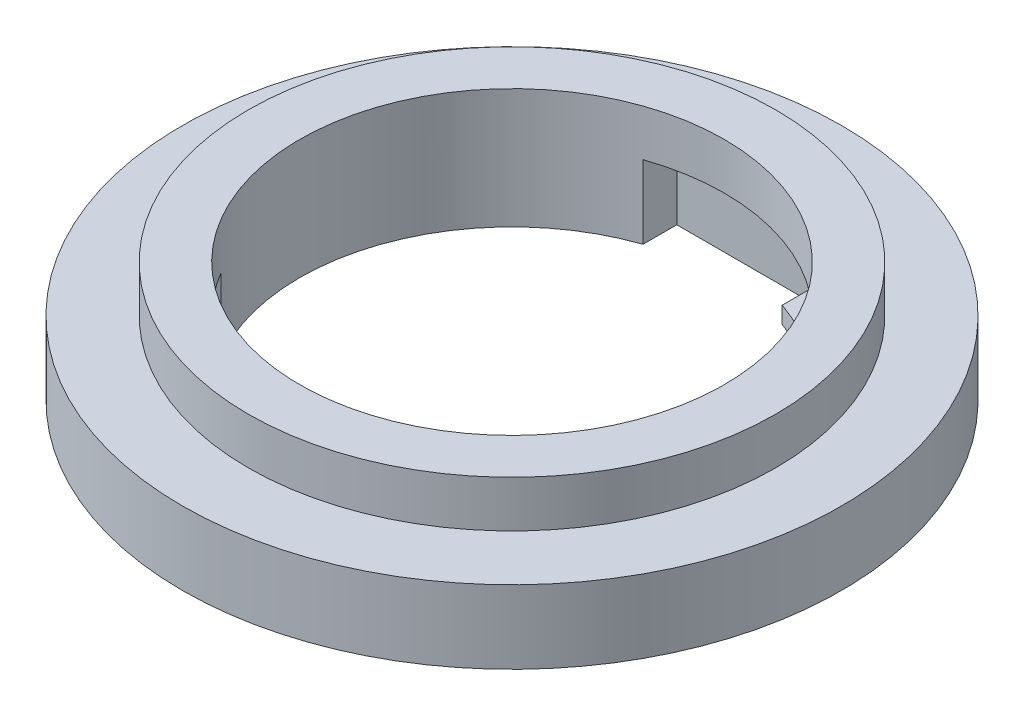
ISO-10303-21;
HEADER;
FILE_DESCRIPTION(('STEP AP214'),'2;1');
FILE_NAME('part.step','',(''),(''),'','','');
FILE_SCHEMA(('AUTOMOTIVE_DESIGN { 1 0 10303 214 1 1 1 1 }'));
ENDSEC;
DATA;
#1=APPLICATION_CONTEXT('core data for automotive mechanical design processes');
#2=APPLICATION_PROTOCOL_DEFINITION('international standard','automotive_design',2000,#1);
#3=PRODUCT_CONTEXT('',#1,'mechanical');
#4=PRODUCT('Part','Part','',(#3));
#5=PRODUCT_RELATED_PRODUCT_CATEGORY('part','',(#4));
#6=PRODUCT_DEFINITION_FORMATION('','',#4);
#7=PRODUCT_DEFINITION_CONTEXT('part definition',#1,'design');
#8=PRODUCT_DEFINITION('design','',#6,#7);
#9=PRODUCT_DEFINITION_SHAPE('','',#8);
#10=(LENGTH_UNIT() NAMED_UNIT(*) SI_UNIT(.MILLI.,.METRE.));
#11=(NAMED_UNIT(*) PLANE_ANGLE_UNIT() SI_UNIT($,.RADIAN.));
#12=(NAMED_UNIT(*) SI_UNIT($,.STERADIAN.) SOLID_ANGLE_UNIT());
#13=UNCERTAINTY_MEASURE_WITH_UNIT(LENGTH_MEASURE(1.E-05),#10,'distance_accuracy_value','');
#14=(GEOMETRIC_REPRESENTATION_CONTEXT(3) GLOBAL_UNCERTAINTY_ASSIGNED_CONTEXT((#13)) GLOBAL_UNIT_ASSIGNED_CONTEXT((#10,
#11,#12)) REPRESENTATION_CONTEXT('',''));
#15=CARTESIAN_POINT('',(0.,0.,0.));
#16=DIRECTION('',(0.,0.,1.));
#17=DIRECTION('',(1.,0.,0.));
#18=AXIS2_PLACEMENT_3D('',#15,#16,#17);
#19=CARTESIAN_POINT('',(0.,6.35,0.));
#20=DIRECTION('',(0.,-1.,0.));
#21=DIRECTION('',(0.,0.,-1.));
#22=AXIS2_PLACEMENT_3D('',#19,#20,#21);
#23=CYLINDRICAL_SURFACE('',#22,36.);
#24=CARTESIAN_POINT('',(0.,6.35,0.));
#25=DIRECTION('',(0.,1.,0.));
#26=DIRECTION('',(0.,0.,1.));
#27=AXIS2_PLACEMENT_3D('',#24,#25,#26);
#28=CIRCLE('',#27,36.);
#29=CARTESIAN_POINT('',(0.,6.35,36.));
#30=VERTEX_POINT('',#29);
#31=EDGE_CURVE('E11',#30,#30,#28,.T.);
#32=ORIENTED_EDGE('',*,*,#31,.F.);
#33=EDGE_LOOP('',(#32));
#34=FACE_BOUND('',#33,.T.);
#35=CARTESIAN_POINT('',(0.,0.,0.));
#36=DIRECTION('',(0.,1.,0.));
#37=DIRECTION('',(0.,0.,1.));
#38=AXIS2_PLACEMENT_3D('',#35,#36,#37);
#39=CIRCLE('',#38,36.);
#40=CARTESIAN_POINT('',(0.,0.,36.));
#41=VERTEX_POINT('',#40);
#42=EDGE_CURVE('E419',#41,#41,#39,.T.);
#43=ORIENTED_EDGE('',*,*,#42,.T.);
#44=EDGE_LOOP('',(#43));
#45=FACE_BOUND('',#44,.T.);
#46=ADVANCED_FACE('F35',(#34,#45),#23,.T.);
#47=CARTESIAN_POINT('',(0.,6.35,0.));
#48=DIRECTION('',(0.,1.,0.));
#49=DIRECTION('',(0.,0.,1.));
#50=AXIS2_PLACEMENT_3D('',#47,#48,#49);
#51=PLANE('',#50);
#52=CARTESIAN_POINT('',(0.,6.35,0.));
#53=DIRECTION('',(0.,-1.,0.));
#54=DIRECTION('',(0.,0.,-1.));
#55=AXIS2_PLACEMENT_3D('',#52,#53,#54);
#56=CIRCLE('',#55,29.);
#57=CARTESIAN_POINT('',(0.,6.35,-29.));
#58=VERTEX_POINT('',#57);
#59=EDGE_CURVE('E45',#58,#58,#56,.T.);
#60=ORIENTED_EDGE('',*,*,#59,.T.);
#61=EDGE_LOOP('',(#60));
#62=FACE_BOUND('',#61,.T.);
#63=ORIENTED_EDGE('',*,*,#31,.T.);
#64=EDGE_LOOP('',(#63));
#65=FACE_BOUND('',#64,.T.);
#66=ADVANCED_FACE('F309',(#62,#65),#51,.T.);
#67=CARTESIAN_POINT('',(0.,6.35,0.));
#68=DIRECTION('',(0.,-1.,0.));
#69=DIRECTION('',(0.,0.,-1.));
#70=AXIS2_PLACEMENT_3D('',#67,#68,#69);
#71=CYLINDRICAL_SURFACE('',#70,29.);
#72=CARTESIAN_POINT('',(0.,0.,0.));
#73=DIRECTION('',(0.,1.,0.));
#74=DIRECTION('',(0.,0.,1.));
#75=AXIS2_PLACEMENT_3D('',#72,#73,#74);
#76=CIRCLE('',#75,29.);
#77=CARTESIAN_POINT('',(-9.50000000000026,0.,27.3998175176404));
#78=VERTEX_POINT('',#77);
#79=CARTESIAN_POINT('',(9.49999999999999,0.,27.3998175176405));
#80=VERTEX_POINT('',#79);
#81=EDGE_CURVE('E266',#78,#80,#76,.T.);
#82=ORIENTED_EDGE('',*,*,#81,.F.);
#83=CARTESIAN_POINT('',(-8.49931755097049,0.,27.7288374938515));
#84=CARTESIAN_POINT('',(-8.83247789560089,0.,27.6244538475428));
#85=CARTESIAN_POINT('',(-9.17088915092117,0.,27.5139260564636));
#86=CARTESIAN_POINT('',(-12.6896811616525,0.,26.2938987741946));
#87=CARTESIAN_POINT('',(-15.7406846591594,0.,24.5963551988527));
#88=CARTESIAN_POINT('',(-21.0413784963023,0.,20.2487095243432));
#89=CARTESIAN_POINT('',(-23.2849703536721,0.,17.6044663622121));
#90=CARTESIAN_POINT('',(-24.9782180370532,0.,14.7339276397514));
#91=B_SPLINE_CURVE_WITH_KNOTS('',3,(#83,#84,#85,#86,#87,#88,#89,#90),.UNSPECIFIED.,.F.,.F.,(4,2,
2,4),(0.,0.0490589796846245,0.524529489842312,1.),.UNSPECIFIED.);
#92=CARTESIAN_POINT('',(-24.9782180370532,0.,14.7339276397514));
#93=VERTEX_POINT('',#92);
#94=EDGE_CURVE('E161',#78,#93,#91,.T.);
#95=ORIENTED_EDGE('',*,*,#94,.T.);
#96=DIRECTION('',(0.,1.,0.));
#97=VECTOR('',#96,1.);
#98=CARTESIAN_POINT('',(-24.9782180370532,0.,14.7339276397514));
#99=LINE('',#98,#97);
#100=CARTESIAN_POINT('',(-24.9782180370532,-7.7,14.7339276397514));
#101=VERTEX_POINT('',#100);
#102=EDGE_CURVE('E156',#101,#93,#99,.T.);
#103=ORIENTED_EDGE('',*,*,#102,.F.);
#104=CARTESIAN_POINT('',(-8.49931755097049,-7.7,27.7288374938515));
#105=CARTESIAN_POINT('',(-8.83247789560089,-7.7,27.6244538475428));
#106=CARTESIAN_POINT('',(-9.17088915092117,-7.7,27.5139260564636));
#107=CARTESIAN_POINT('',(-12.6896811616525,-7.7,26.2938987741946));
#108=CARTESIAN_POINT('',(-15.7406846591594,-7.7,24.5963551988527));
#109=CARTESIAN_POINT('',(-21.0413784963023,-7.7,20.2487095243432));
#110=CARTESIAN_POINT('',(-23.2849703536721,-7.7,17.6044663622121));
#111=CARTESIAN_POINT('',(-24.9782180370532,-7.7,14.7339276397514));
#112=B_SPLINE_CURVE_WITH_KNOTS('',3,(#104,#105,#106,#107,#108,#109,#110,#111),.UNSPECIFIED.,.F.,
.F.,(4,2,2,4),(0.,0.0490589796846245,0.524529489842312,1.),.UNSPECIFIED.);
#113=CARTESIAN_POINT('',(-9.5,-7.7,27.3998175176405));
#114=VERTEX_POINT('',#113);
#115=EDGE_CURVE('E164',#114,#101,#112,.T.);
#116=ORIENTED_EDGE('',*,*,#115,.F.);
#117=DIRECTION('',(0.,-1.,0.));
#118=VECTOR('',#117,1.);
#119=CARTESIAN_POINT('',(-9.5,0.,27.3998175176405));
#120=LINE('',#119,#118);
#121=CARTESIAN_POINT('',(-9.5,-10.,27.3998175176405));
#122=VERTEX_POINT('',#121);
#123=EDGE_CURVE('E279',#114,#122,#120,.T.);
#124=ORIENTED_EDGE('',*,*,#123,.T.);
#125=CARTESIAN_POINT('',(0.,-10.,0.));
#126=DIRECTION('',(0.,-1.,0.));
#127=DIRECTION('',(0.,0.,-1.));
#128=AXIS2_PLACEMENT_3D('',#125,#126,#127);
#129=CIRCLE('',#128,29.);
#130=CARTESIAN_POINT('',(-9.5,-10.,-27.3998175176405));
#131=VERTEX_POINT('',#130);
#132=EDGE_CURVE('E278',#122,#131,#129,.T.);
#133=ORIENTED_EDGE('',*,*,#132,.T.);
#134=DIRECTION('',(0.,-1.,0.));
#135=VECTOR('',#134,1.);
#136=CARTESIAN_POINT('',(-9.5,0.,-27.3998175176405));
#137=LINE('',#136,#135);
#138=CARTESIAN_POINT('',(-9.5,0.,-27.3998175176405));
#139=VERTEX_POINT('',#138);
#140=EDGE_CURVE('E271',#139,#131,#137,.T.);
#141=ORIENTED_EDGE('',*,*,#140,.F.);
#142=CARTESIAN_POINT('',(0.,0.,0.));
#143=DIRECTION('',(0.,1.,0.));
#144=DIRECTION('',(0.,0.,-1.));
#145=AXIS2_PLACEMENT_3D('',#142,#143,#144);
#146=CIRCLE('',#145,29.);
#147=CARTESIAN_POINT('',(9.50000000000025,0.,-27.3998175176404));
#148=VERTEX_POINT('',#147);
#149=EDGE_CURVE('E339',#148,#139,#146,.T.);
#150=ORIENTED_EDGE('',*,*,#149,.F.);
#151=CARTESIAN_POINT('',(8.49931755097048,0.,-27.7288374938515));
#152=CARTESIAN_POINT('',(8.83247789559945,0.,-27.6244538475373));
#153=CARTESIAN_POINT('',(9.17088915092117,0.,-27.5139260564648));
#154=CARTESIAN_POINT('',(12.6896811616525,0.,-26.2938987741829));
#155=CARTESIAN_POINT('',(15.7406846591534,0.,-24.5963551988527));
#156=CARTESIAN_POINT('',(21.0413784963083,0.,-20.2487095243432));
#157=CARTESIAN_POINT('',(23.2849703536922,0.,-17.6044663622265));
#158=CARTESIAN_POINT('',(24.9782180370532,0.,-14.7339276397514));
#159=B_SPLINE_CURVE_WITH_KNOTS('',3,(#151,#152,#153,#154,#155,#156,#157,#158),.UNSPECIFIED.,.F.,
.F.,(4,2,2,4),(0.,0.0490589796846245,0.524529489842312,1.),.UNSPECIFIED.);
#160=CARTESIAN_POINT('',(24.9782180370532,0.,-14.7339276397514));
#161=VERTEX_POINT('',#160);
#162=EDGE_CURVE('E334',#148,#161,#159,.T.);
#163=ORIENTED_EDGE('',*,*,#162,.T.);
#164=DIRECTION('',(0.,1.,0.));
#165=VECTOR('',#164,1.);
#166=CARTESIAN_POINT('',(24.9782180370532,0.,-14.7339276397514));
#167=LINE('',#166,#165);
#168=CARTESIAN_POINT('',(24.9782180370532,-7.7,-14.7339276397514));
#169=VERTEX_POINT('',#168);
#170=EDGE_CURVE('E258',#169,#161,#167,.T.);
#171=ORIENTED_EDGE('',*,*,#170,.F.);
#172=CARTESIAN_POINT('',(8.49931755097048,-7.7,-27.7288374938515));
#173=CARTESIAN_POINT('',(8.83247789559945,-7.7,-27.6244538475373));
#174=CARTESIAN_POINT('',(9.17088915092117,-7.7,-27.5139260564648));
#175=CARTESIAN_POINT('',(12.6896811616525,-7.7,-26.2938987741829));
#176=CARTESIAN_POINT('',(15.7406846591534,-7.7,-24.5963551988527));
#177=CARTESIAN_POINT('',(21.0413784963083,-7.7,-20.2487095243432));
#178=CARTESIAN_POINT('',(23.2849703536922,-7.7,-17.6044663622265));
#179=CARTESIAN_POINT('',(24.9782180370532,-7.7,-14.7339276397514));
#180=B_SPLINE_CURVE_WITH_KNOTS('',3,(#172,#173,#174,#175,#176,#177,#178,#179),.UNSPECIFIED.,.F.,
.F.,(4,2,2,4),(0.,0.0490589796846245,0.524529489842312,1.),.UNSPECIFIED.);
#181=CARTESIAN_POINT('',(9.5,-7.7,-27.3998175176405));
#182=VERTEX_POINT('',#181);
#183=EDGE_CURVE('E342',#182,#169,#180,.T.);
#184=ORIENTED_EDGE('',*,*,#183,.F.);
#185=DIRECTION('',(0.,-1.,0.));
#186=VECTOR('',#185,1.);
#187=CARTESIAN_POINT('',(9.49999999999999,0.,-27.3998175176405));
#188=LINE('',#187,#186);
#189=CARTESIAN_POINT('',(9.49999999999999,-10.,-27.3998175176405));
#190=VERTEX_POINT('',#189);
#191=EDGE_CURVE('E414',#182,#190,#188,.T.);
#192=ORIENTED_EDGE('',*,*,#191,.T.);
#193=CARTESIAN_POINT('',(9.5,-10.,27.3998175176405));
#194=VERTEX_POINT('',#193);
#195=EDGE_CURVE('E428',#190,#194,#129,.T.);
#196=ORIENTED_EDGE('',*,*,#195,.T.);
#197=DIRECTION('',(0.,-1.,0.));
#198=VECTOR('',#197,1.);
#199=CARTESIAN_POINT('',(9.49999999999999,0.,27.3998175176405));
#200=LINE('',#199,#198);
#201=EDGE_CURVE('E276',#80,#194,#200,.T.);
#202=ORIENTED_EDGE('',*,*,#201,.F.);
#203=EDGE_LOOP('',(#82,#95,#103,#116,#124,#133,#141,#150,#163,#171,#184,#192,#196,#202));
#204=FACE_BOUND('',#203,.T.);
#205=ORIENTED_EDGE('',*,*,#59,.F.);
#206=EDGE_LOOP('',(#205));
#207=FACE_BOUND('',#206,.T.);
#208=ADVANCED_FACE('F299',(#204,#207),#71,.F.);
#209=CARTESIAN_POINT('',(0.,-10.,0.));
#210=DIRECTION('',(0.,-1.,0.));
#211=DIRECTION('',(0.,0.,-1.));
#212=AXIS2_PLACEMENT_3D('',#209,#210,#211);
#213=PLANE('',#212);
#214=DIRECTION('',(0.,0.,-1.));
#215=VECTOR('',#214,1.);
#216=CARTESIAN_POINT('',(-9.5,-10.,29.));
#217=LINE('',#216,#215);
#218=CARTESIAN_POINT('',(-9.5,-10.,32.));
#219=VERTEX_POINT('',#218);
#220=EDGE_CURVE('E264',#219,#122,#217,.T.);
#221=ORIENTED_EDGE('',*,*,#220,.F.);
#222=DIRECTION('',(-1.,0.,0.));
#223=VECTOR('',#222,1.);
#224=CARTESIAN_POINT('',(-9.5,-10.,32.));
#225=LINE('',#224,#223);
#226=CARTESIAN_POINT('',(9.5,-10.,32.));
#227=VERTEX_POINT('',#226);
#228=EDGE_CURVE('E270',#227,#219,#225,.T.);
#229=ORIENTED_EDGE('',*,*,#228,.F.);
#230=DIRECTION('',(0.,0.,1.));
#231=VECTOR('',#230,1.);
#232=CARTESIAN_POINT('',(9.5,-10.,32.));
#233=LINE('',#232,#231);
#234=EDGE_CURVE('E267',#194,#227,#233,.T.);
#235=ORIENTED_EDGE('',*,*,#234,.F.);
#236=ORIENTED_EDGE('',*,*,#195,.F.);
#237=DIRECTION('',(0.,0.,1.));
#238=VECTOR('',#237,1.);
#239=CARTESIAN_POINT('',(9.5,-10.,-29.));
#240=LINE('',#239,#238);
#241=CARTESIAN_POINT('',(9.5,-10.,-32.));
#242=VERTEX_POINT('',#241);
#243=EDGE_CURVE('E408',#242,#190,#240,.T.);
#244=ORIENTED_EDGE('',*,*,#243,.F.);
#245=DIRECTION('',(1.,0.,0.));
#246=VECTOR('',#245,1.);
#247=CARTESIAN_POINT('',(-9.5,-10.,-32.));
#248=LINE('',#247,#246);
#249=CARTESIAN_POINT('',(-9.5,-10.,-32.));
#250=VERTEX_POINT('',#249);
#251=EDGE_CURVE('E253',#250,#242,#248,.T.);
#252=ORIENTED_EDGE('',*,*,#251,.F.);
#253=DIRECTION('',(0.,0.,-1.));
#254=VECTOR('',#253,1.);
#255=CARTESIAN_POINT('',(-9.5,-10.,-29.));
#256=LINE('',#255,#254);
#257=EDGE_CURVE('E404',#131,#250,#256,.T.);
#258=ORIENTED_EDGE('',*,*,#257,.F.);
#259=ORIENTED_EDGE('',*,*,#132,.F.);
#260=EDGE_LOOP('',(#221,#229,#235,#236,#244,#252,#258,#259));
#261=FACE_BOUND('',#260,.T.);
#262=CARTESIAN_POINT('',(0.,-10.,0.));
#263=DIRECTION('',(0.,-1.,0.));
#264=DIRECTION('',(0.,0.,-1.));
#265=AXIS2_PLACEMENT_3D('',#262,#263,#264);
#266=CIRCLE('',#265,45.);
#267=CARTESIAN_POINT('',(0.,-10.,-45.));
#268=VERTEX_POINT('',#267);
#269=EDGE_CURVE('E421',#268,#268,#266,.T.);
#270=ORIENTED_EDGE('',*,*,#269,.T.);
#271=EDGE_LOOP('',(#270));
#272=FACE_BOUND('',#271,.T.);
#273=ADVANCED_FACE('F308',(#261,#272),#213,.T.);
#274=CARTESIAN_POINT('',(0.,0.,0.));
#275=DIRECTION('',(0.,-1.,0.));
#276=DIRECTION('',(0.,0.,-1.));
#277=AXIS2_PLACEMENT_3D('',#274,#275,#276);
#278=PLANE('',#277);
#279=ORIENTED_EDGE('',*,*,#42,.F.);
#280=EDGE_LOOP('',(#279));
#281=FACE_BOUND('',#280,.T.);
#282=CARTESIAN_POINT('',(0.,0.,0.));
#283=DIRECTION('',(0.,-1.,0.));
#284=DIRECTION('',(0.,0.,-1.));
#285=AXIS2_PLACEMENT_3D('',#282,#283,#284);
#286=CIRCLE('',#285,45.);
#287=CARTESIAN_POINT('',(0.,0.,-45.));
#288=VERTEX_POINT('',#287);
#289=EDGE_CURVE('E425',#288,#288,#286,.T.);
#290=ORIENTED_EDGE('',*,*,#289,.F.);
#291=EDGE_LOOP('',(#290));
#292=FACE_BOUND('',#291,.T.);
#293=ADVANCED_FACE('F473',(#281,#292),#278,.F.);
#294=CARTESIAN_POINT('',(0.,-10.,0.));
#295=DIRECTION('',(0.,1.,0.));
#296=DIRECTION('',(0.,0.,1.));
#297=AXIS2_PLACEMENT_3D('',#294,#295,#296);
#298=CYLINDRICAL_SURFACE('',#297,45.);
#299=ORIENTED_EDGE('',*,*,#269,.F.);
#300=EDGE_LOOP('',(#299));
#301=FACE_BOUND('',#300,.T.);
#302=ORIENTED_EDGE('',*,*,#289,.T.);
#303=EDGE_LOOP('',(#302));
#304=FACE_BOUND('',#303,.T.);
#305=ADVANCED_FACE('F310',(#301,#304),#298,.T.);
#306=CARTESIAN_POINT('',(-9.5,0.,-29.));
#307=DIRECTION('',(-1.,0.,0.));
#308=DIRECTION('',(0.,0.,1.));
#309=AXIS2_PLACEMENT_3D('',#306,#307,#308);
#310=PLANE('',#309);
#311=ORIENTED_EDGE('',*,*,#257,.T.);
#312=DIRECTION('',(0.,-1.,0.));
#313=VECTOR('',#312,1.);
#314=CARTESIAN_POINT('',(-9.5,0.,-32.));
#315=LINE('',#314,#313);
#316=CARTESIAN_POINT('',(-9.5,0.,-32.));
#317=VERTEX_POINT('',#316);
#318=EDGE_CURVE('E432',#317,#250,#315,.T.);
#319=ORIENTED_EDGE('',*,*,#318,.F.);
#320=DIRECTION('',(0.,0.,-1.));
#321=VECTOR('',#320,1.);
#322=CARTESIAN_POINT('',(-9.5,0.,-32.));
#323=LINE('',#322,#321);
#324=EDGE_CURVE('E400',#139,#317,#323,.T.);
#325=ORIENTED_EDGE('',*,*,#324,.F.);
#326=ORIENTED_EDGE('',*,*,#140,.T.);
#327=EDGE_LOOP('',(#311,#319,#325,#326));
#328=FACE_BOUND('',#327,.T.);
#329=ADVANCED_FACE('F441',(#328),#310,.F.);
#330=CARTESIAN_POINT('',(9.5,0.,-29.));
#331=DIRECTION('',(1.,0.,0.));
#332=DIRECTION('',(0.,0.,-1.));
#333=AXIS2_PLACEMENT_3D('',#330,#331,#332);
#334=PLANE('',#333);
#335=ORIENTED_EDGE('',*,*,#191,.F.);
#336=DIRECTION('',(0.,0.,-1.));
#337=VECTOR('',#336,1.);
#338=CARTESIAN_POINT('',(9.5,-7.7,-32.3269332060335));
#339=LINE('',#338,#337);
#340=CARTESIAN_POINT('',(9.5,-7.7,-32.0000000017371));
#341=VERTEX_POINT('',#340);
#342=EDGE_CURVE('E245',#182,#341,#339,.T.);
#343=ORIENTED_EDGE('',*,*,#342,.T.);
#344=DIRECTION('',(0.,-1.,0.));
#345=VECTOR('',#344,1.);
#346=CARTESIAN_POINT('',(9.5,0.,-32.));
#347=LINE('',#346,#345);
#348=EDGE_CURVE('E433',#341,#242,#347,.T.);
#349=ORIENTED_EDGE('',*,*,#348,.T.);
#350=ORIENTED_EDGE('',*,*,#243,.T.);
#351=EDGE_LOOP('',(#335,#343,#349,#350));
#352=FACE_BOUND('',#351,.T.);
#353=ADVANCED_FACE('F451',(#352),#334,.F.);
#354=CARTESIAN_POINT('',(-9.5,0.,-32.));
#355=DIRECTION('',(0.,0.,-1.));
#356=DIRECTION('',(-1.,0.,0.));
#357=AXIS2_PLACEMENT_3D('',#354,#355,#356);
#358=PLANE('',#357);
#359=ORIENTED_EDGE('',*,*,#251,.T.);
#360=ORIENTED_EDGE('',*,*,#348,.F.);
#361=CARTESIAN_POINT('',(9.5,0.,-32.0000000017371));
#362=VERTEX_POINT('',#361);
#363=EDGE_CURVE('E377',#362,#341,#347,.T.);
#364=ORIENTED_EDGE('',*,*,#363,.F.);
#365=DIRECTION('',(1.,0.,0.));
#366=VECTOR('',#365,1.);
#367=CARTESIAN_POINT('',(-9.5,0.,-32.));
#368=LINE('',#367,#366);
#369=EDGE_CURVE('E403',#317,#362,#368,.T.);
#370=ORIENTED_EDGE('',*,*,#369,.F.);
#371=ORIENTED_EDGE('',*,*,#318,.T.);
#372=EDGE_LOOP('',(#359,#360,#364,#370,#371));
#373=FACE_BOUND('',#372,.T.);
#374=ADVANCED_FACE('F448',(#373),#358,.F.);
#375=CARTESIAN_POINT('',(0.,0.,0.));
#376=DIRECTION('',(0.,-1.,0.));
#377=DIRECTION('',(0.,0.,-1.));
#378=AXIS2_PLACEMENT_3D('',#375,#376,#377);
#379=PLANE('',#378);
#380=ORIENTED_EDGE('',*,*,#324,.T.);
#381=ORIENTED_EDGE('',*,*,#369,.T.);
#382=CARTESIAN_POINT('',(8.3607726390421,0.,-32.3269332060335));
#383=CARTESIAN_POINT('',(8.73177960111534,0.,-32.2236435065039));
#384=CARTESIAN_POINT('',(9.11426370372973,0.,-32.1141085397579));
#385=CARTESIAN_POINT('',(13.2384844681441,0.,-30.8940812474944));
#386=CARTESIAN_POINT('',(16.8097096041533,0.,-29.1050754423536));
#387=CARTESIAN_POINT('',(23.154704565864,0.,-24.3724488089365));
#388=CARTESIAN_POINT('',(25.8506946656925,0.,-21.4602013197169));
#389=CARTESIAN_POINT('',(27.9561732624306,0.,-18.2401309348634));
#390=B_SPLINE_CURVE_WITH_KNOTS('',3,(#382,#383,#384,#385,#386,#387,#388,#389),.UNSPECIFIED.,.F.,
.F.,(4,2,2,4),(0.,0.0490589796846245,0.524529489842312,1.),.UNSPECIFIED.);
#391=CARTESIAN_POINT('',(27.9561732624306,0.,-18.2401309348634));
#392=VERTEX_POINT('',#391);
#393=EDGE_CURVE('E355',#362,#392,#390,.T.);
#394=ORIENTED_EDGE('',*,*,#393,.T.);
#395=DIRECTION('',(0.647355890075455,0.,-0.762187871580633));
#396=VECTOR('',#395,1.);
#397=CARTESIAN_POINT('',(27.9561732624306,0.,-18.2401309348634));
#398=LINE('',#397,#396);
#399=EDGE_CURVE('E254',#161,#392,#398,.T.);
#400=ORIENTED_EDGE('',*,*,#399,.F.);
#401=ORIENTED_EDGE('',*,*,#162,.F.);
#402=ORIENTED_EDGE('',*,*,#149,.T.);
#403=EDGE_LOOP('',(#380,#381,#394,#400,#401,#402));
#404=FACE_BOUND('',#403,.T.);
#405=ADVANCED_FACE('F436',(#404),#379,.T.);
#406=CARTESIAN_POINT('',(-9.5,0.,29.));
#407=DIRECTION('',(-1.,0.,0.));
#408=DIRECTION('',(0.,0.,1.));
#409=AXIS2_PLACEMENT_3D('',#406,#407,#408);
#410=PLANE('',#409);
#411=ORIENTED_EDGE('',*,*,#123,.F.);
#412=DIRECTION('',(0.,0.,1.));
#413=VECTOR('',#412,1.);
#414=CARTESIAN_POINT('',(-9.5,-7.7,27.7288374938515));
#415=LINE('',#414,#413);
#416=CARTESIAN_POINT('',(-9.49999999999999,-7.7,32.0000000017371));
#417=VERTEX_POINT('',#416);
#418=EDGE_CURVE('E157',#114,#417,#415,.T.);
#419=ORIENTED_EDGE('',*,*,#418,.T.);
#420=DIRECTION('',(0.,-1.,0.));
#421=VECTOR('',#420,1.);
#422=CARTESIAN_POINT('',(-9.5,0.,32.));
#423=LINE('',#422,#421);
#424=EDGE_CURVE('E391',#417,#219,#423,.T.);
#425=ORIENTED_EDGE('',*,*,#424,.T.);
#426=ORIENTED_EDGE('',*,*,#220,.T.);
#427=EDGE_LOOP('',(#411,#419,#425,#426));
#428=FACE_BOUND('',#427,.T.);
#429=ADVANCED_FACE('F390',(#428),#410,.F.);
#430=CARTESIAN_POINT('',(-9.5,0.,32.));
#431=DIRECTION('',(0.,0.,1.));
#432=DIRECTION('',(1.,0.,0.));
#433=AXIS2_PLACEMENT_3D('',#430,#431,#432);
#434=PLANE('',#433);
#435=ORIENTED_EDGE('',*,*,#228,.T.);
#436=ORIENTED_EDGE('',*,*,#424,.F.);
#437=CARTESIAN_POINT('',(-9.49999999999999,0.,32.0000000017371));
#438=VERTEX_POINT('',#437);
#439=EDGE_CURVE('E282',#438,#417,#423,.T.);
#440=ORIENTED_EDGE('',*,*,#439,.F.);
#441=DIRECTION('',(-1.,0.,0.));
#442=VECTOR('',#441,1.);
#443=CARTESIAN_POINT('',(-9.5,0.,32.));
#444=LINE('',#443,#442);
#445=CARTESIAN_POINT('',(9.5,0.,32.));
#446=VERTEX_POINT('',#445);
#447=EDGE_CURVE('E147',#446,#438,#444,.T.);
#448=ORIENTED_EDGE('',*,*,#447,.F.);
#449=DIRECTION('',(0.,-1.,0.));
#450=VECTOR('',#449,1.);
#451=CARTESIAN_POINT('',(9.5,0.,32.));
#452=LINE('',#451,#450);
#453=EDGE_CURVE('E396',#446,#227,#452,.T.);
#454=ORIENTED_EDGE('',*,*,#453,.T.);
#455=EDGE_LOOP('',(#435,#436,#440,#448,#454));
#456=FACE_BOUND('',#455,.T.);
#457=ADVANCED_FACE('F393',(#456),#434,.F.);
#458=CARTESIAN_POINT('',(9.5,0.,32.));
#459=DIRECTION('',(1.,0.,0.));
#460=DIRECTION('',(0.,0.,-1.));
#461=AXIS2_PLACEMENT_3D('',#458,#459,#460);
#462=PLANE('',#461);
#463=ORIENTED_EDGE('',*,*,#234,.T.);
#464=ORIENTED_EDGE('',*,*,#453,.F.);
#465=DIRECTION('',(0.,0.,1.));
#466=VECTOR('',#465,1.);
#467=CARTESIAN_POINT('',(9.5,0.,29.));
#468=LINE('',#467,#466);
#469=EDGE_CURVE('E262',#80,#446,#468,.T.);
#470=ORIENTED_EDGE('',*,*,#469,.F.);
#471=ORIENTED_EDGE('',*,*,#201,.T.);
#472=EDGE_LOOP('',(#463,#464,#470,#471));
#473=FACE_BOUND('',#472,.T.);
#474=ADVANCED_FACE('F455',(#473),#462,.F.);
#475=CARTESIAN_POINT('',(0.,0.,0.));
#476=DIRECTION('',(0.,1.,0.));
#477=DIRECTION('',(0.,0.,1.));
#478=AXIS2_PLACEMENT_3D('',#475,#476,#477);
#479=PLANE('',#478);
#480=ORIENTED_EDGE('',*,*,#469,.T.);
#481=ORIENTED_EDGE('',*,*,#447,.T.);
#482=CARTESIAN_POINT('',(-8.36077263904207,0.,32.3269332060335));
#483=CARTESIAN_POINT('',(-8.73177960111542,0.,32.2236435065265));
#484=CARTESIAN_POINT('',(-9.11426370373757,0.,32.1141085397566));
#485=CARTESIAN_POINT('',(-13.2384844680679,0.,30.8940812475061));
#486=CARTESIAN_POINT('',(-16.8097096041592,0.,29.1050754423477));
#487=CARTESIAN_POINT('',(-23.154704565858,0.,24.3724488089424));
#488=CARTESIAN_POINT('',(-25.8506946656583,0.,21.4602013196872));
#489=CARTESIAN_POINT('',(-27.9561732624305,0.,18.2401309348635));
#490=B_SPLINE_CURVE_WITH_KNOTS('',3,(#482,#483,#484,#485,#486,#487,#488,#489),.UNSPECIFIED.,.F.,
.F.,(4,2,2,4),(0.,0.0490589796846245,0.524529489842312,1.),.UNSPECIFIED.);
#491=CARTESIAN_POINT('',(-27.9561732624305,0.,18.2401309348635));
#492=VERTEX_POINT('',#491);
#493=EDGE_CURVE('E141',#438,#492,#490,.T.);
#494=ORIENTED_EDGE('',*,*,#493,.T.);
#495=DIRECTION('',(-0.647355890075452,0.,0.762187871580635));
#496=VECTOR('',#495,1.);
#497=CARTESIAN_POINT('',(-24.9782180370532,0.,14.7339276397514));
#498=LINE('',#497,#496);
#499=EDGE_CURVE('E144',#93,#492,#498,.T.);
#500=ORIENTED_EDGE('',*,*,#499,.F.);
#501=ORIENTED_EDGE('',*,*,#94,.F.);
#502=ORIENTED_EDGE('',*,*,#81,.T.);
#503=EDGE_LOOP('',(#480,#481,#494,#500,#501,#502));
#504=FACE_BOUND('',#503,.T.);
#505=ADVANCED_FACE('F143',(#504),#479,.F.);
#506=CARTESIAN_POINT('',(7.24078478001598,0.,6.14988095571681));
#507=DIRECTION('',(-0.762187871580633,0.,-0.647355890075456));
#508=DIRECTION('',(-0.647355890075455,0.,0.762187871580633));
#509=AXIS2_PLACEMENT_3D('',#506,#507,#508);
#510=PLANE('',#509);
#511=DIRECTION('',(0.,-1.,0.));
#512=VECTOR('',#511,1.);
#513=CARTESIAN_POINT('',(27.9561732624306,0.,-18.2401309348634));
#514=LINE('',#513,#512);
#515=CARTESIAN_POINT('',(27.9561732624306,-7.7,-18.2401309348634));
#516=VERTEX_POINT('',#515);
#517=EDGE_CURVE('E259',#392,#516,#514,.T.);
#518=ORIENTED_EDGE('',*,*,#517,.T.);
#519=DIRECTION('',(-0.647355890075455,0.,0.762187871580633));
#520=VECTOR('',#519,1.);
#521=CARTESIAN_POINT('',(27.9561732624306,-7.7,-18.2401309348634));
#522=LINE('',#521,#520);
#523=EDGE_CURVE('E61',#516,#169,#522,.T.);
#524=ORIENTED_EDGE('',*,*,#523,.T.);
#525=ORIENTED_EDGE('',*,*,#170,.T.);
#526=ORIENTED_EDGE('',*,*,#399,.T.);
#527=EDGE_LOOP('',(#518,#524,#525,#526));
#528=FACE_BOUND('',#527,.T.);
#529=ADVANCED_FACE('F237',(#528),#510,.T.);
#530=CARTESIAN_POINT('',(8.3607726390421,-7.7,-32.3269332060335));
#531=DIRECTION('',(0.,1.,0.));
#532=DIRECTION('',(0.,0.,1.));
#533=AXIS2_PLACEMENT_3D('',#530,#531,#532);
#534=PLANE('',#533);
#535=ORIENTED_EDGE('',*,*,#183,.T.);
#536=ORIENTED_EDGE('',*,*,#523,.F.);
#537=CARTESIAN_POINT('',(8.3607726390421,-7.7,-32.3269332060335));
#538=CARTESIAN_POINT('',(8.73177960111534,-7.7,-32.2236435065039));
#539=CARTESIAN_POINT('',(9.11426370372973,-7.7,-32.1141085397579));
#540=CARTESIAN_POINT('',(13.2384844681441,-7.7,-30.8940812474944));
#541=CARTESIAN_POINT('',(16.8097096041533,-7.7,-29.1050754423536));
#542=CARTESIAN_POINT('',(23.154704565864,-7.7,-24.3724488089365));
#543=CARTESIAN_POINT('',(25.8506946656925,-7.7,-21.4602013197169));
#544=CARTESIAN_POINT('',(27.9561732624306,-7.7,-18.2401309348634));
#545=B_SPLINE_CURVE_WITH_KNOTS('',3,(#537,#538,#539,#540,#541,#542,#543,#544),.UNSPECIFIED.,.F.,
.F.,(4,2,2,4),(0.,0.0490589796846245,0.524529489842312,1.),.UNSPECIFIED.);
#546=EDGE_CURVE('E345',#341,#516,#545,.T.);
#547=ORIENTED_EDGE('',*,*,#546,.F.);
#548=ORIENTED_EDGE('',*,*,#342,.F.);
#549=EDGE_LOOP('',(#535,#536,#547,#548));
#550=FACE_BOUND('',#549,.T.);
#551=ADVANCED_FACE('F227',(#550),#534,.T.);
#552=CARTESIAN_POINT('',(8.3607726390421,0.,-32.3269332060335));
#553=CARTESIAN_POINT('',(8.73177960111534,0.,-32.2236435065039));
#554=CARTESIAN_POINT('',(9.11426370372973,0.,-32.1141085397579));
#555=CARTESIAN_POINT('',(13.2384844681441,0.,-30.8940812474944));
#556=CARTESIAN_POINT('',(16.8097096041533,0.,-29.1050754423536));
#557=CARTESIAN_POINT('',(23.154704565864,0.,-24.3724488089365));
#558=CARTESIAN_POINT('',(25.8506946656925,0.,-21.4602013197169));
#559=CARTESIAN_POINT('',(27.9561732624306,0.,-18.2401309348634));
#560=CARTESIAN_POINT('',(8.3607726390421,-7.7,-32.3269332060335));
#561=CARTESIAN_POINT('',(8.73177960111534,-7.7,-32.2236435065039));
#562=CARTESIAN_POINT('',(9.11426370372973,-7.7,-32.1141085397579));
#563=CARTESIAN_POINT('',(13.2384844681441,-7.7,-30.8940812474944));
#564=CARTESIAN_POINT('',(16.8097096041533,-7.7,-29.1050754423536));
#565=CARTESIAN_POINT('',(23.154704565864,-7.7,-24.3724488089365));
#566=CARTESIAN_POINT('',(25.8506946656925,-7.7,-21.4602013197169));
#567=CARTESIAN_POINT('',(27.9561732624306,-7.7,-18.2401309348634));
#568=B_SPLINE_SURFACE_WITH_KNOTS('',1,3,((#552,#553,#554,#555,#556,#557,#558,#559),(#560,#561,
#562,#563,#564,#565,#566,#567)),.UNSPECIFIED.,.F.,.F.,.F.,(2,2),(4,2,2,4),(0.,1.),(0.,
0.0490589796846245,0.524529489842312,1.),.UNSPECIFIED.);
#569=ORIENTED_EDGE('',*,*,#546,.T.);
#570=ORIENTED_EDGE('',*,*,#517,.F.);
#571=ORIENTED_EDGE('',*,*,#393,.F.);
#572=ORIENTED_EDGE('',*,*,#363,.T.);
#573=EDGE_LOOP('',(#569,#570,#571,#572));
#574=FACE_BOUND('',#573,.T.);
#575=ADVANCED_FACE('F222',(#574),#568,.T.);
#576=CARTESIAN_POINT('',(-7.24078478001608,0.,-6.14988095571684));
#577=DIRECTION('',(-0.762187871580635,0.,-0.647355890075452));
#578=DIRECTION('',(-0.647355890075452,0.,0.762187871580635));
#579=AXIS2_PLACEMENT_3D('',#576,#577,#578);
#580=PLANE('',#579);
#581=ORIENTED_EDGE('',*,*,#102,.T.);
#582=ORIENTED_EDGE('',*,*,#499,.T.);
#583=DIRECTION('',(0.,-1.,0.));
#584=VECTOR('',#583,1.);
#585=CARTESIAN_POINT('',(-27.9561732624305,0.,18.2401309348635));
#586=LINE('',#585,#584);
#587=CARTESIAN_POINT('',(-27.9561732624305,-7.7,18.2401309348635));
#588=VERTEX_POINT('',#587);
#589=EDGE_CURVE('E154',#492,#588,#586,.T.);
#590=ORIENTED_EDGE('',*,*,#589,.T.);
#591=DIRECTION('',(0.647355890075452,0.,-0.762187871580635));
#592=VECTOR('',#591,1.);
#593=CARTESIAN_POINT('',(-24.9782180370532,-7.7,14.7339276397514));
#594=LINE('',#593,#592);
#595=EDGE_CURVE('E53',#588,#101,#594,.T.);
#596=ORIENTED_EDGE('',*,*,#595,.T.);
#597=EDGE_LOOP('',(#581,#582,#590,#596));
#598=FACE_BOUND('',#597,.T.);
#599=ADVANCED_FACE('F153',(#598),#580,.F.);
#600=CARTESIAN_POINT('',(-8.49931755097049,-7.7,27.7288374938515));
#601=DIRECTION('',(0.,1.,0.));
#602=DIRECTION('',(0.,0.,1.));
#603=AXIS2_PLACEMENT_3D('',#600,#601,#602);
#604=PLANE('',#603);
#605=ORIENTED_EDGE('',*,*,#115,.T.);
#606=ORIENTED_EDGE('',*,*,#595,.F.);
#607=CARTESIAN_POINT('',(-8.36077263904207,-7.7,32.3269332060335));
#608=CARTESIAN_POINT('',(-8.73177960111542,-7.7,32.2236435065265));
#609=CARTESIAN_POINT('',(-9.11426370373757,-7.7,32.1141085397566));
#610=CARTESIAN_POINT('',(-13.2384844680679,-7.7,30.8940812475061));
#611=CARTESIAN_POINT('',(-16.8097096041592,-7.7,29.1050754423477));
#612=CARTESIAN_POINT('',(-23.154704565858,-7.7,24.3724488089424));
#613=CARTESIAN_POINT('',(-25.8506946656583,-7.7,21.4602013196872));
#614=CARTESIAN_POINT('',(-27.9561732624305,-7.7,18.2401309348635));
#615=B_SPLINE_CURVE_WITH_KNOTS('',3,(#607,#608,#609,#610,#611,#612,#613,#614),.UNSPECIFIED.,.F.,
.F.,(4,2,2,4),(0.,0.0490589796846245,0.524529489842312,1.),.UNSPECIFIED.);
#616=EDGE_CURVE('E151',#417,#588,#615,.T.);
#617=ORIENTED_EDGE('',*,*,#616,.F.);
#618=ORIENTED_EDGE('',*,*,#418,.F.);
#619=EDGE_LOOP('',(#605,#606,#617,#618));
#620=FACE_BOUND('',#619,.T.);
#621=ADVANCED_FACE('F208',(#620),#604,.T.);
#622=CARTESIAN_POINT('',(-8.36077263904207,0.,32.3269332060335));
#623=CARTESIAN_POINT('',(-8.73177960111542,0.,32.2236435065265));
#624=CARTESIAN_POINT('',(-9.11426370373757,0.,32.1141085397566));
#625=CARTESIAN_POINT('',(-13.2384844680679,0.,30.8940812475061));
#626=CARTESIAN_POINT('',(-16.8097096041592,0.,29.1050754423477));
#627=CARTESIAN_POINT('',(-23.154704565858,0.,24.3724488089424));
#628=CARTESIAN_POINT('',(-25.8506946656583,0.,21.4602013196872));
#629=CARTESIAN_POINT('',(-27.9561732624305,0.,18.2401309348635));
#630=CARTESIAN_POINT('',(-8.36077263904207,-7.7,32.3269332060335));
#631=CARTESIAN_POINT('',(-8.73177960111542,-7.7,32.2236435065265));
#632=CARTESIAN_POINT('',(-9.11426370373757,-7.7,32.1141085397566));
#633=CARTESIAN_POINT('',(-13.2384844680679,-7.7,30.8940812475061));
#634=CARTESIAN_POINT('',(-16.8097096041592,-7.7,29.1050754423477));
#635=CARTESIAN_POINT('',(-23.154704565858,-7.7,24.3724488089424));
#636=CARTESIAN_POINT('',(-25.8506946656583,-7.7,21.4602013196872));
#637=CARTESIAN_POINT('',(-27.9561732624305,-7.7,18.2401309348635));
#638=B_SPLINE_SURFACE_WITH_KNOTS('',1,3,((#622,#623,#624,#625,#626,#627,#628,#629),(#630,#631,
#632,#633,#634,#635,#636,#637)),.UNSPECIFIED.,.F.,.F.,.F.,(2,2),(4,2,2,4),(0.,1.),(0.,
0.0490589796846245,0.524529489842312,1.),.UNSPECIFIED.);
#639=ORIENTED_EDGE('',*,*,#616,.T.);
#640=ORIENTED_EDGE('',*,*,#589,.F.);
#641=ORIENTED_EDGE('',*,*,#493,.F.);
#642=ORIENTED_EDGE('',*,*,#439,.T.);
#643=EDGE_LOOP('',(#639,#640,#641,#642));
#644=FACE_BOUND('',#643,.T.);
#645=ADVANCED_FACE('F159',(#644),#638,.T.);
#646=CLOSED_SHELL('',(#46,#66,#208,#273,#293,#305,#329,#353,#374,#405,#429,#457,#474,#505,#529,
#551,#575,#599,#621,#645));
#647=MANIFOLD_SOLID_BREP('B2',#646);
#648=ADVANCED_BREP_SHAPE_REPRESENTATION('',(#18,#647),#14);
#649=SHAPE_DEFINITION_REPRESENTATION(#9,#648);
ENDSEC;
END-ISO-10303-21;
